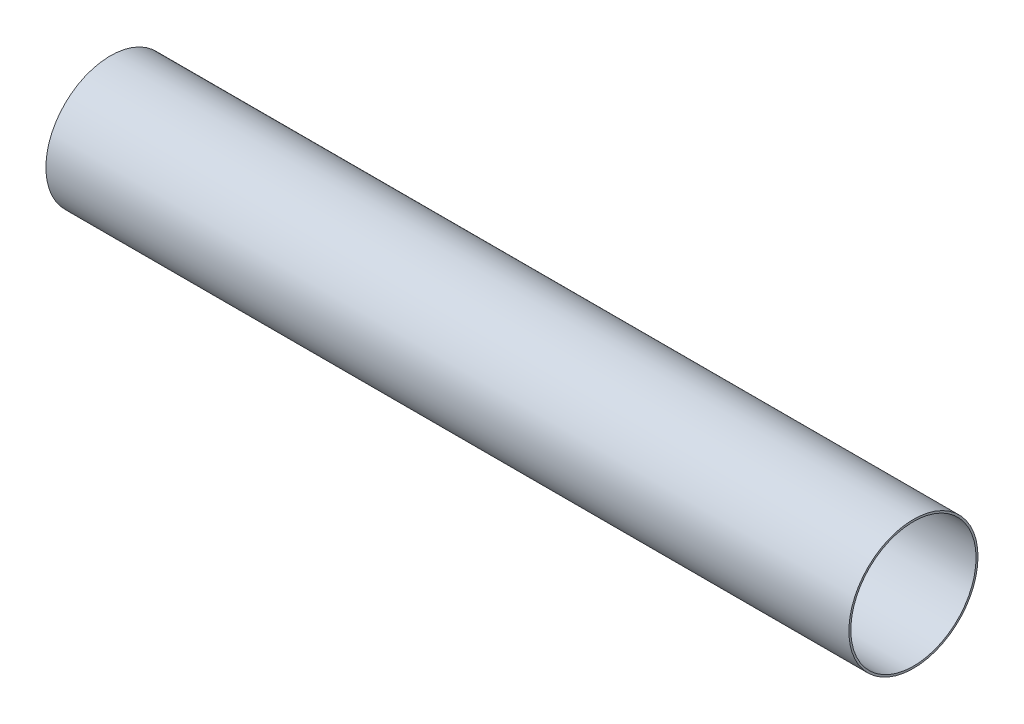
ISO-10303-21;
HEADER;
FILE_DESCRIPTION(('STEP AP214'),'2;1');
FILE_NAME('part.step','',(''),(''),'','','');
FILE_SCHEMA(('AUTOMOTIVE_DESIGN { 1 0 10303 214 1 1 1 1 }'));
ENDSEC;
DATA;
#1=APPLICATION_CONTEXT('core data for automotive mechanical design processes');
#2=APPLICATION_PROTOCOL_DEFINITION('international standard','automotive_design',2000,#1);
#3=PRODUCT_CONTEXT('',#1,'mechanical');
#4=PRODUCT('Part','Part','',(#3));
#5=PRODUCT_RELATED_PRODUCT_CATEGORY('part','',(#4));
#6=PRODUCT_DEFINITION_FORMATION('','',#4);
#7=PRODUCT_DEFINITION_CONTEXT('part definition',#1,'design');
#8=PRODUCT_DEFINITION('design','',#6,#7);
#9=PRODUCT_DEFINITION_SHAPE('','',#8);
#10=(LENGTH_UNIT() NAMED_UNIT(*) SI_UNIT(.MILLI.,.METRE.));
#11=(NAMED_UNIT(*) PLANE_ANGLE_UNIT() SI_UNIT($,.RADIAN.));
#12=(NAMED_UNIT(*) SI_UNIT($,.STERADIAN.) SOLID_ANGLE_UNIT());
#13=UNCERTAINTY_MEASURE_WITH_UNIT(LENGTH_MEASURE(1.E-05),#10,'distance_accuracy_value','');
#14=(GEOMETRIC_REPRESENTATION_CONTEXT(3) GLOBAL_UNCERTAINTY_ASSIGNED_CONTEXT((#13)) GLOBAL_UNIT_ASSIGNED_CONTEXT((#10,
#11,#12)) REPRESENTATION_CONTEXT('',''));
#15=CARTESIAN_POINT('',(0.,0.,0.));
#16=DIRECTION('',(0.,0.,1.));
#17=DIRECTION('',(1.,0.,0.));
#18=AXIS2_PLACEMENT_3D('',#15,#16,#17);
#19=CARTESIAN_POINT('',(635.,0.,0.));
#20=DIRECTION('',(1.,0.,0.));
#21=DIRECTION('',(0.,0.,-1.));
#22=AXIS2_PLACEMENT_3D('',#19,#20,#21);
#23=PLANE('',#22);
#24=CARTESIAN_POINT('',(635.,0.,0.));
#25=DIRECTION('',(1.,0.,0.));
#26=DIRECTION('',(0.,0.,-1.));
#27=AXIS2_PLACEMENT_3D('',#24,#25,#26);
#28=CIRCLE('',#27,51.054);
#29=CARTESIAN_POINT('',(635.,0.,-51.054));
#30=VERTEX_POINT('',#29);
#31=EDGE_CURVE('E10',#30,#30,#28,.T.);
#32=ORIENTED_EDGE('',*,*,#31,.T.);
#33=EDGE_LOOP('',(#32));
#34=FACE_BOUND('',#33,.T.);
#35=CARTESIAN_POINT('',(635.,0.,0.));
#36=DIRECTION('',(1.,0.,0.));
#37=DIRECTION('',(0.,0.,-1.));
#38=AXIS2_PLACEMENT_3D('',#35,#36,#37);
#39=CIRCLE('',#38,49.53);
#40=CARTESIAN_POINT('',(635.,0.,-49.53));
#41=VERTEX_POINT('',#40);
#42=EDGE_CURVE('E50',#41,#41,#39,.T.);
#43=ORIENTED_EDGE('',*,*,#42,.F.);
#44=EDGE_LOOP('',(#43));
#45=FACE_BOUND('',#44,.T.);
#46=ADVANCED_FACE('F39',(#34,#45),#23,.T.);
#47=CARTESIAN_POINT('',(0.,0.,0.));
#48=DIRECTION('',(1.,0.,0.));
#49=DIRECTION('',(0.,0.,-1.));
#50=AXIS2_PLACEMENT_3D('',#47,#48,#49);
#51=PLANE('',#50);
#52=CARTESIAN_POINT('',(0.,0.,0.));
#53=DIRECTION('',(1.,0.,0.));
#54=DIRECTION('',(0.,0.,-1.));
#55=AXIS2_PLACEMENT_3D('',#52,#53,#54);
#56=CIRCLE('',#55,51.054);
#57=CARTESIAN_POINT('',(0.,0.,-51.054));
#58=VERTEX_POINT('',#57);
#59=EDGE_CURVE('E43',#58,#58,#56,.T.);
#60=ORIENTED_EDGE('',*,*,#59,.F.);
#61=EDGE_LOOP('',(#60));
#62=FACE_BOUND('',#61,.T.);
#63=CARTESIAN_POINT('',(0.,0.,0.));
#64=DIRECTION('',(1.,0.,0.));
#65=DIRECTION('',(0.,0.,-1.));
#66=AXIS2_PLACEMENT_3D('',#63,#64,#65);
#67=CIRCLE('',#66,49.53);
#68=CARTESIAN_POINT('',(0.,0.,-49.53));
#69=VERTEX_POINT('',#68);
#70=EDGE_CURVE('E52',#69,#69,#67,.T.);
#71=ORIENTED_EDGE('',*,*,#70,.T.);
#72=EDGE_LOOP('',(#71));
#73=FACE_BOUND('',#72,.T.);
#74=ADVANCED_FACE('F62',(#62,#73),#51,.F.);
#75=CARTESIAN_POINT('',(635.,0.,0.));
#76=DIRECTION('',(-1.,0.,0.));
#77=DIRECTION('',(0.,0.,1.));
#78=AXIS2_PLACEMENT_3D('',#75,#76,#77);
#79=CYLINDRICAL_SURFACE('',#78,51.054);
#80=ORIENTED_EDGE('',*,*,#31,.F.);
#81=EDGE_LOOP('',(#80));
#82=FACE_BOUND('',#81,.T.);
#83=ORIENTED_EDGE('',*,*,#59,.T.);
#84=EDGE_LOOP('',(#83));
#85=FACE_BOUND('',#84,.T.);
#86=ADVANCED_FACE('F41',(#82,#85),#79,.T.);
#87=CARTESIAN_POINT('',(635.,0.,0.));
#88=DIRECTION('',(-1.,0.,0.));
#89=DIRECTION('',(0.,0.,1.));
#90=AXIS2_PLACEMENT_3D('',#87,#88,#89);
#91=CYLINDRICAL_SURFACE('',#90,49.53);
#92=ORIENTED_EDGE('',*,*,#42,.T.);
#93=EDGE_LOOP('',(#92));
#94=FACE_BOUND('',#93,.T.);
#95=ORIENTED_EDGE('',*,*,#70,.F.);
#96=EDGE_LOOP('',(#95));
#97=FACE_BOUND('',#96,.T.);
#98=ADVANCED_FACE('F58',(#94,#97),#91,.F.);
#99=CLOSED_SHELL('',(#46,#74,#86,#98));
#100=MANIFOLD_SOLID_BREP('B2',#99);
#101=ADVANCED_BREP_SHAPE_REPRESENTATION('',(#18,#100),#14);
#102=SHAPE_DEFINITION_REPRESENTATION(#9,#101);
ENDSEC;
END-ISO-10303-21;
